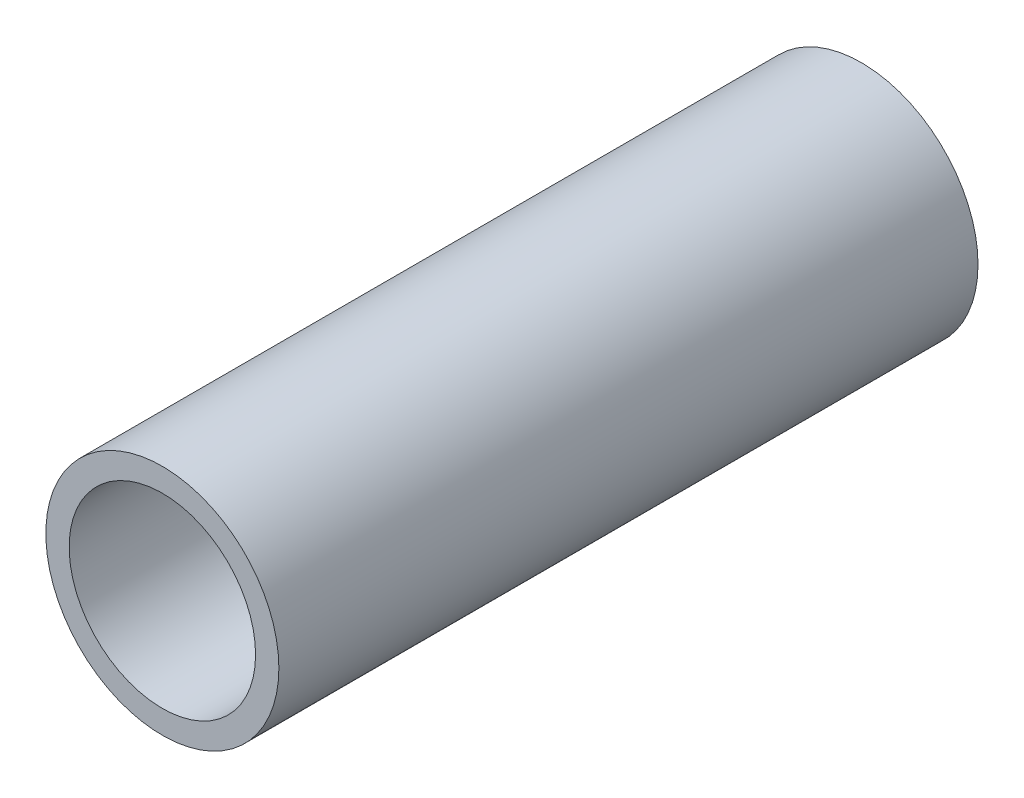
ISO-10303-21;
HEADER;
FILE_DESCRIPTION(('STEP AP214'),'2;1');
FILE_NAME('part.step','',(''),(''),'','','');
FILE_SCHEMA(('AUTOMOTIVE_DESIGN { 1 0 10303 214 1 1 1 1 }'));
ENDSEC;
DATA;
#1=APPLICATION_CONTEXT('core data for automotive mechanical design processes');
#2=APPLICATION_PROTOCOL_DEFINITION('international standard','automotive_design',2000,#1);
#3=PRODUCT_CONTEXT('',#1,'mechanical');
#4=PRODUCT('Part','Part','',(#3));
#5=PRODUCT_RELATED_PRODUCT_CATEGORY('part','',(#4));
#6=PRODUCT_DEFINITION_FORMATION('','',#4);
#7=PRODUCT_DEFINITION_CONTEXT('part definition',#1,'design');
#8=PRODUCT_DEFINITION('design','',#6,#7);
#9=PRODUCT_DEFINITION_SHAPE('','',#8);
#10=(LENGTH_UNIT() NAMED_UNIT(*) SI_UNIT(.MILLI.,.METRE.));
#11=(NAMED_UNIT(*) PLANE_ANGLE_UNIT() SI_UNIT($,.RADIAN.));
#12=(NAMED_UNIT(*) SI_UNIT($,.STERADIAN.) SOLID_ANGLE_UNIT());
#13=UNCERTAINTY_MEASURE_WITH_UNIT(LENGTH_MEASURE(1.E-05),#10,'distance_accuracy_value','');
#14=(GEOMETRIC_REPRESENTATION_CONTEXT(3) GLOBAL_UNCERTAINTY_ASSIGNED_CONTEXT((#13)) GLOBAL_UNIT_ASSIGNED_CONTEXT((#10,
#11,#12)) REPRESENTATION_CONTEXT('',''));
#15=CARTESIAN_POINT('',(0.,0.,0.));
#16=DIRECTION('',(0.,0.,1.));
#17=DIRECTION('',(1.,0.,0.));
#18=AXIS2_PLACEMENT_3D('',#15,#16,#17);
#19=CARTESIAN_POINT('',(0.,0.,7.5));
#20=DIRECTION('',(0.,0.,1.));
#21=DIRECTION('',(1.,0.,0.));
#22=AXIS2_PLACEMENT_3D('',#19,#20,#21);
#23=PLANE('',#22);
#24=CARTESIAN_POINT('',(0.,0.,7.5));
#25=DIRECTION('',(0.,0.,1.));
#26=DIRECTION('',(1.,0.,0.));
#27=AXIS2_PLACEMENT_3D('',#24,#25,#26);
#28=CIRCLE('',#27,1.25);
#29=CARTESIAN_POINT('',(1.25,0.,7.5));
#30=VERTEX_POINT('',#29);
#31=EDGE_CURVE('E10',#30,#30,#28,.T.);
#32=ORIENTED_EDGE('',*,*,#31,.T.);
#33=EDGE_LOOP('',(#32));
#34=FACE_BOUND('',#33,.T.);
#35=CARTESIAN_POINT('',(0.,0.,7.5));
#36=DIRECTION('',(0.,0.,1.));
#37=DIRECTION('',(1.,0.,0.));
#38=AXIS2_PLACEMENT_3D('',#35,#36,#37);
#39=CIRCLE('',#38,1.);
#40=CARTESIAN_POINT('',(1.,0.,7.5));
#41=VERTEX_POINT('',#40);
#42=EDGE_CURVE('E41',#41,#41,#39,.T.);
#43=ORIENTED_EDGE('',*,*,#42,.F.);
#44=EDGE_LOOP('',(#43));
#45=FACE_BOUND('',#44,.T.);
#46=ADVANCED_FACE('F30',(#34,#45),#23,.T.);
#47=CARTESIAN_POINT('',(0.,0.,0.));
#48=DIRECTION('',(0.,0.,1.));
#49=DIRECTION('',(1.,0.,0.));
#50=AXIS2_PLACEMENT_3D('',#47,#48,#49);
#51=PLANE('',#50);
#52=CARTESIAN_POINT('',(0.,0.,0.));
#53=DIRECTION('',(0.,0.,1.));
#54=DIRECTION('',(1.,0.,0.));
#55=AXIS2_PLACEMENT_3D('',#52,#53,#54);
#56=CIRCLE('',#55,1.25);
#57=CARTESIAN_POINT('',(1.25,0.,0.));
#58=VERTEX_POINT('',#57);
#59=EDGE_CURVE('E34',#58,#58,#56,.T.);
#60=ORIENTED_EDGE('',*,*,#59,.F.);
#61=EDGE_LOOP('',(#60));
#62=FACE_BOUND('',#61,.T.);
#63=CARTESIAN_POINT('',(0.,0.,0.));
#64=DIRECTION('',(0.,0.,1.));
#65=DIRECTION('',(1.,0.,0.));
#66=AXIS2_PLACEMENT_3D('',#63,#64,#65);
#67=CIRCLE('',#66,1.);
#68=CARTESIAN_POINT('',(1.,0.,0.));
#69=VERTEX_POINT('',#68);
#70=EDGE_CURVE('E43',#69,#69,#67,.T.);
#71=ORIENTED_EDGE('',*,*,#70,.T.);
#72=EDGE_LOOP('',(#71));
#73=FACE_BOUND('',#72,.T.);
#74=ADVANCED_FACE('F53',(#62,#73),#51,.F.);
#75=CARTESIAN_POINT('',(0.,0.,7.5));
#76=DIRECTION('',(0.,0.,-1.));
#77=DIRECTION('',(-1.,0.,0.));
#78=AXIS2_PLACEMENT_3D('',#75,#76,#77);
#79=CYLINDRICAL_SURFACE('',#78,1.25);
#80=ORIENTED_EDGE('',*,*,#31,.F.);
#81=EDGE_LOOP('',(#80));
#82=FACE_BOUND('',#81,.T.);
#83=ORIENTED_EDGE('',*,*,#59,.T.);
#84=EDGE_LOOP('',(#83));
#85=FACE_BOUND('',#84,.T.);
#86=ADVANCED_FACE('F32',(#82,#85),#79,.T.);
#87=CARTESIAN_POINT('',(0.,0.,7.5));
#88=DIRECTION('',(0.,0.,-1.));
#89=DIRECTION('',(-1.,0.,0.));
#90=AXIS2_PLACEMENT_3D('',#87,#88,#89);
#91=CYLINDRICAL_SURFACE('',#90,1.);
#92=ORIENTED_EDGE('',*,*,#42,.T.);
#93=EDGE_LOOP('',(#92));
#94=FACE_BOUND('',#93,.T.);
#95=ORIENTED_EDGE('',*,*,#70,.F.);
#96=EDGE_LOOP('',(#95));
#97=FACE_BOUND('',#96,.T.);
#98=ADVANCED_FACE('F49',(#94,#97),#91,.F.);
#99=CLOSED_SHELL('',(#46,#74,#86,#98));
#100=MANIFOLD_SOLID_BREP('B2',#99);
#101=ADVANCED_BREP_SHAPE_REPRESENTATION('',(#18,#100),#14);
#102=SHAPE_DEFINITION_REPRESENTATION(#9,#101);
ENDSEC;
END-ISO-10303-21;
